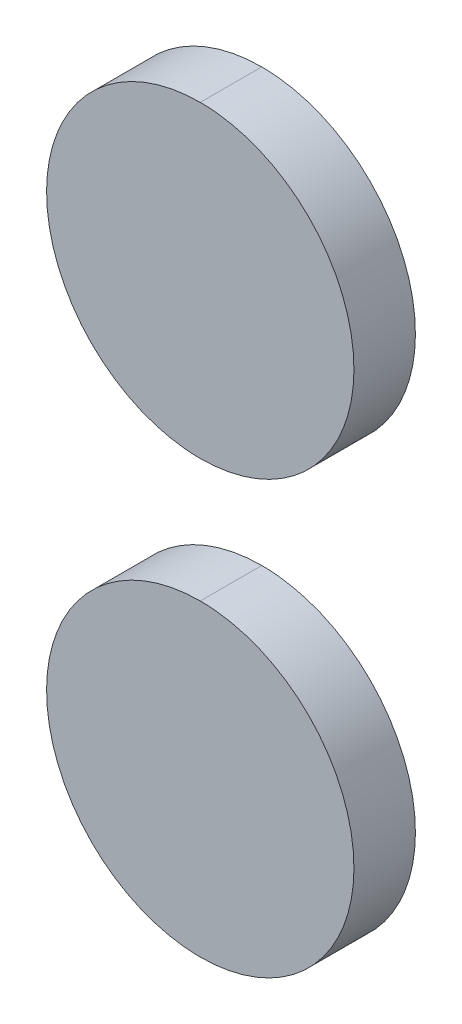
ISO-10303-21;
HEADER;
FILE_DESCRIPTION(('STEP AP214'),'2;1');
FILE_NAME('part.step','',(''),(''),'','','');
FILE_SCHEMA(('AUTOMOTIVE_DESIGN { 1 0 10303 214 1 1 1 1 }'));
ENDSEC;
DATA;
#1=APPLICATION_CONTEXT('core data for automotive mechanical design processes');
#2=APPLICATION_PROTOCOL_DEFINITION('international standard','automotive_design',2000,#1);
#3=PRODUCT_CONTEXT('',#1,'mechanical');
#4=PRODUCT('Part','Part','',(#3));
#5=PRODUCT_RELATED_PRODUCT_CATEGORY('part','',(#4));
#6=PRODUCT_DEFINITION_FORMATION('','',#4);
#7=PRODUCT_DEFINITION_CONTEXT('part definition',#1,'design');
#8=PRODUCT_DEFINITION('design','',#6,#7);
#9=PRODUCT_DEFINITION_SHAPE('','',#8);
#10=(LENGTH_UNIT() NAMED_UNIT(*) SI_UNIT(.MILLI.,.METRE.));
#11=(NAMED_UNIT(*) PLANE_ANGLE_UNIT() SI_UNIT($,.RADIAN.));
#12=(NAMED_UNIT(*) SI_UNIT($,.STERADIAN.) SOLID_ANGLE_UNIT());
#13=UNCERTAINTY_MEASURE_WITH_UNIT(LENGTH_MEASURE(1.E-05),#10,'distance_accuracy_value','');
#14=(GEOMETRIC_REPRESENTATION_CONTEXT(3) GLOBAL_UNCERTAINTY_ASSIGNED_CONTEXT((#13)) GLOBAL_UNIT_ASSIGNED_CONTEXT((#10,
#11,#12)) REPRESENTATION_CONTEXT('',''));
#15=CARTESIAN_POINT('',(0.,0.,0.));
#16=DIRECTION('',(0.,0.,1.));
#17=DIRECTION('',(1.,0.,0.));
#18=AXIS2_PLACEMENT_3D('',#15,#16,#17);
#19=CARTESIAN_POINT('',(5.4,62.520933434628,0.5));
#20=CARTESIAN_POINT('',(5.4,62.520933434628,0.));
#21=CARTESIAN_POINT('',(2.90000000000001,62.520933434628,0.499999999999999));
#22=CARTESIAN_POINT('',(2.90000000000001,62.520933434628,0.));
#23=CARTESIAN_POINT('',(2.90000000000001,60.0122678973796,0.499999999999999));
#24=CARTESIAN_POINT('',(2.90000000000001,60.0122678973796,0.));
#25=CARTESIAN_POINT('',(5.4,60.0122678973796,0.5));
#26=CARTESIAN_POINT('',(5.4,60.0122678973796,0.));
#27=(BOUNDED_SURFACE() B_SPLINE_SURFACE(3,1,((#19,#20),(#21,#22),(#23,#24),(#25,#26)),
.UNSPECIFIED.,.F.,.F.,.F.) B_SPLINE_SURFACE_WITH_KNOTS((4,4),(2,2),(0.,1.),(0.,1.),
.UNSPECIFIED.) GEOMETRIC_REPRESENTATION_ITEM() RATIONAL_B_SPLINE_SURFACE(((1.,1.),
(0.333333333333334,0.333333333333334),(0.333333333333334,0.333333333333334),(1.,1.))) REPRESENTATION_ITEM('') SURFACE());
#28=CARTESIAN_POINT('',(5.4,62.520933434628,0.5));
#29=CARTESIAN_POINT('',(2.90000000000001,62.520933434628,0.499999999999999));
#30=CARTESIAN_POINT('',(2.90000000000001,60.0122678973796,0.499999999999999));
#31=CARTESIAN_POINT('',(5.4,60.0122678973796,0.5));
#32=(BOUNDED_CURVE() B_SPLINE_CURVE(3,(#28,#29,#30,#31),.UNSPECIFIED.,.F.,
.F.) B_SPLINE_CURVE_WITH_KNOTS((4,4),(3.1415926535898,6.28318530717959),
.UNSPECIFIED.) CURVE() GEOMETRIC_REPRESENTATION_ITEM() RATIONAL_B_SPLINE_CURVE((1.,
0.333333333333334,0.333333333333334,1.)) REPRESENTATION_ITEM(''));
#33=CARTESIAN_POINT('',(5.4,62.520933434628,0.5));
#34=VERTEX_POINT('',#33);
#35=CARTESIAN_POINT('',(5.4,60.0122678973796,0.5));
#36=VERTEX_POINT('',#35);
#37=EDGE_CURVE('P0_E40',#34,#36,#32,.T.);
#38=DIRECTION('',(0.,0.,-1.));
#39=VECTOR('',#38,1.);
#40=CARTESIAN_POINT('',(5.4,62.520933434628,0.5));
#41=LINE('',#40,#39);
#42=CARTESIAN_POINT('',(5.4,62.520933434628,0.));
#43=VERTEX_POINT('',#42);
#44=EDGE_CURVE('P0_E11',#34,#43,#41,.T.);
#45=CARTESIAN_POINT('',(5.4,62.520933434628,0.));
#46=CARTESIAN_POINT('',(2.90000000000001,62.520933434628,0.));
#47=CARTESIAN_POINT('',(2.90000000000001,60.0122678973796,0.));
#48=CARTESIAN_POINT('',(5.4,60.0122678973796,0.));
#49=(BOUNDED_CURVE() B_SPLINE_CURVE(3,(#45,#46,#47,#48),.UNSPECIFIED.,.F.,
.F.) B_SPLINE_CURVE_WITH_KNOTS((4,4),(3.1415926535898,6.28318530717959),
.UNSPECIFIED.) CURVE() GEOMETRIC_REPRESENTATION_ITEM() RATIONAL_B_SPLINE_CURVE((1.,
0.333333333333334,0.333333333333334,1.)) REPRESENTATION_ITEM(''));
#50=CARTESIAN_POINT('',(5.4,60.0122678973796,0.));
#51=VERTEX_POINT('',#50);
#52=EDGE_CURVE('P0_E20',#43,#51,#49,.T.);
#53=DIRECTION('',(0.,0.,-1.));
#54=VECTOR('',#53,1.);
#55=CARTESIAN_POINT('',(5.4,60.0122678973796,0.5));
#56=LINE('',#55,#54);
#57=EDGE_CURVE('P0_E59',#36,#51,#56,.T.);
#58=ORIENTED_EDGE('',*,*,#37,.F.);
#59=ORIENTED_EDGE('',*,*,#44,.T.);
#60=ORIENTED_EDGE('',*,*,#52,.T.);
#61=ORIENTED_EDGE('',*,*,#57,.F.);
#62=EDGE_LOOP('',(#58,#59,#60,#61));
#63=FACE_BOUND('',#62,.T.);
#64=ADVANCED_FACE('P0_F16',(#63),#27,.F.);
#65=CARTESIAN_POINT('',(5.4,60.0122678973796,0.5));
#66=CARTESIAN_POINT('',(5.4,60.0122678973796,0.));
#67=CARTESIAN_POINT('',(7.9,60.0122678973796,0.499999999999999));
#68=CARTESIAN_POINT('',(7.9,60.0122678973796,0.));
#69=CARTESIAN_POINT('',(7.9,62.520933434628,0.499999999999999));
#70=CARTESIAN_POINT('',(7.9,62.520933434628,0.));
#71=CARTESIAN_POINT('',(5.4,62.520933434628,0.5));
#72=CARTESIAN_POINT('',(5.4,62.520933434628,0.));
#73=(BOUNDED_SURFACE() B_SPLINE_SURFACE(3,1,((#65,#66),(#67,#68),(#69,#70),(#71,#72)),
.UNSPECIFIED.,.F.,.F.,.F.) B_SPLINE_SURFACE_WITH_KNOTS((4,4),(2,2),(0.,1.),(0.,1.),
.UNSPECIFIED.) GEOMETRIC_REPRESENTATION_ITEM() RATIONAL_B_SPLINE_SURFACE(((1.,1.),
(0.333333333333334,0.333333333333334),(0.333333333333334,0.333333333333334),(1.,1.))) REPRESENTATION_ITEM('') SURFACE());
#74=CARTESIAN_POINT('',(5.4,60.0122678973796,0.5));
#75=CARTESIAN_POINT('',(7.9,60.0122678973796,0.499999999999999));
#76=CARTESIAN_POINT('',(7.9,62.520933434628,0.499999999999999));
#77=CARTESIAN_POINT('',(5.4,62.520933434628,0.5));
#78=(BOUNDED_CURVE() B_SPLINE_CURVE(3,(#74,#75,#76,#77),.UNSPECIFIED.,.F.,
.F.) B_SPLINE_CURVE_WITH_KNOTS((4,4),(0.,3.1415926535898),
.UNSPECIFIED.) CURVE() GEOMETRIC_REPRESENTATION_ITEM() RATIONAL_B_SPLINE_CURVE((1.,
0.333333333333334,0.333333333333334,1.)) REPRESENTATION_ITEM(''));
#79=EDGE_CURVE('P0_E55',#36,#34,#78,.T.);
#80=CARTESIAN_POINT('',(5.4,60.0122678973796,0.));
#81=CARTESIAN_POINT('',(7.9,60.0122678973796,0.));
#82=CARTESIAN_POINT('',(7.9,62.520933434628,0.));
#83=CARTESIAN_POINT('',(5.4,62.520933434628,0.));
#84=(BOUNDED_CURVE() B_SPLINE_CURVE(3,(#80,#81,#82,#83),.UNSPECIFIED.,.F.,
.F.) B_SPLINE_CURVE_WITH_KNOTS((4,4),(0.,3.1415926535898),
.UNSPECIFIED.) CURVE() GEOMETRIC_REPRESENTATION_ITEM() RATIONAL_B_SPLINE_CURVE((1.,
0.333333333333334,0.333333333333334,1.)) REPRESENTATION_ITEM(''));
#85=EDGE_CURVE('P0_E64',#51,#43,#84,.T.);
#86=ORIENTED_EDGE('',*,*,#44,.F.);
#87=ORIENTED_EDGE('',*,*,#79,.F.);
#88=ORIENTED_EDGE('',*,*,#57,.T.);
#89=ORIENTED_EDGE('',*,*,#85,.T.);
#90=EDGE_LOOP('',(#86,#87,#88,#89));
#91=FACE_BOUND('',#90,.T.);
#92=ADVANCED_FACE('P0_F66',(#91),#73,.F.);
#93=CARTESIAN_POINT('',(5.4,61.2666006660038,0.5));
#94=DIRECTION('',(0.,0.,1.));
#95=DIRECTION('',(1.,0.,0.));
#96=AXIS2_PLACEMENT_3D('',#93,#94,#95);
#97=PLANE('',#96);
#98=ORIENTED_EDGE('',*,*,#79,.T.);
#99=ORIENTED_EDGE('',*,*,#37,.T.);
#100=EDGE_LOOP('',(#98,#99));
#101=FACE_BOUND('',#100,.T.);
#102=ADVANCED_FACE('P0_F53',(#101),#97,.T.);
#103=CARTESIAN_POINT('',(5.4,61.2666006660038,0.));
#104=DIRECTION('',(0.,0.,1.));
#105=DIRECTION('',(1.,0.,0.));
#106=AXIS2_PLACEMENT_3D('',#103,#104,#105);
#107=PLANE('',#106);
#108=ORIENTED_EDGE('',*,*,#85,.F.);
#109=ORIENTED_EDGE('',*,*,#52,.F.);
#110=EDGE_LOOP('',(#108,#109));
#111=FACE_BOUND('',#110,.T.);
#112=ADVANCED_FACE('P0_F18',(#111),#107,.F.);
#113=CLOSED_SHELL('',(#64,#92,#102,#112));
#114=MANIFOLD_SOLID_BREP('P0_B1',#113);
#115=CARTESIAN_POINT('',(5.4,59.0088016824802,0.5));
#116=CARTESIAN_POINT('',(5.4,59.0088016824802,0.));
#117=CARTESIAN_POINT('',(2.9,59.0088016824802,0.499999999999999));
#118=CARTESIAN_POINT('',(2.9,59.0088016824802,0.));
#119=CARTESIAN_POINT('',(2.9,56.5001361452319,0.499999999999999));
#120=CARTESIAN_POINT('',(2.9,56.5001361452319,0.));
#121=CARTESIAN_POINT('',(5.4,56.5001361452319,0.5));
#122=CARTESIAN_POINT('',(5.4,56.5001361452319,0.));
#123=(BOUNDED_SURFACE() B_SPLINE_SURFACE(3,1,((#115,#116),(#117,#118),(#119,#120),(#121,#122)),
.UNSPECIFIED.,.F.,.F.,.F.) B_SPLINE_SURFACE_WITH_KNOTS((4,4),(2,2),(0.,1.),(0.,1.),
.UNSPECIFIED.) GEOMETRIC_REPRESENTATION_ITEM() RATIONAL_B_SPLINE_SURFACE(((1.,1.),
(0.333333333333334,0.333333333333334),(0.333333333333334,0.333333333333334),(1.,1.))) REPRESENTATION_ITEM('') SURFACE());
#124=CARTESIAN_POINT('',(5.4,59.0088016824802,0.5));
#125=CARTESIAN_POINT('',(2.9,59.0088016824802,0.499999999999999));
#126=CARTESIAN_POINT('',(2.9,56.5001361452319,0.499999999999999));
#127=CARTESIAN_POINT('',(5.4,56.5001361452319,0.5));
#128=(BOUNDED_CURVE() B_SPLINE_CURVE(3,(#124,#125,#126,#127),.UNSPECIFIED.,.F.,
.F.) B_SPLINE_CURVE_WITH_KNOTS((4,4),(3.1415926535898,6.28318530717959),
.UNSPECIFIED.) CURVE() GEOMETRIC_REPRESENTATION_ITEM() RATIONAL_B_SPLINE_CURVE((1.,
0.333333333333334,0.333333333333334,1.)) REPRESENTATION_ITEM(''));
#129=CARTESIAN_POINT('',(5.4,59.0088016824802,0.5));
#130=VERTEX_POINT('',#129);
#131=CARTESIAN_POINT('',(5.4,56.5001361452319,0.5));
#132=VERTEX_POINT('',#131);
#133=EDGE_CURVE('P1_E44',#130,#132,#128,.T.);
#134=DIRECTION('',(0.,0.,-1.));
#135=VECTOR('',#134,1.);
#136=CARTESIAN_POINT('',(5.4,59.0088016824802,0.5));
#137=LINE('',#136,#135);
#138=CARTESIAN_POINT('',(5.4,59.0088016824802,0.));
#139=VERTEX_POINT('',#138);
#140=EDGE_CURVE('P1_E11',#130,#139,#137,.T.);
#141=CARTESIAN_POINT('',(5.4,59.0088016824802,0.));
#142=CARTESIAN_POINT('',(2.9,59.0088016824802,0.));
#143=CARTESIAN_POINT('',(2.9,56.5001361452319,0.));
#144=CARTESIAN_POINT('',(5.4,56.5001361452319,0.));
#145=(BOUNDED_CURVE() B_SPLINE_CURVE(3,(#141,#142,#143,#144),.UNSPECIFIED.,.F.,
.F.) B_SPLINE_CURVE_WITH_KNOTS((4,4),(3.1415926535898,6.28318530717959),
.UNSPECIFIED.) CURVE() GEOMETRIC_REPRESENTATION_ITEM() RATIONAL_B_SPLINE_CURVE((1.,
0.333333333333334,0.333333333333334,1.)) REPRESENTATION_ITEM(''));
#146=CARTESIAN_POINT('',(5.4,56.5001361452319,0.));
#147=VERTEX_POINT('',#146);
#148=EDGE_CURVE('P1_E31',#139,#147,#145,.T.);
#149=DIRECTION('',(0.,0.,-1.));
#150=VECTOR('',#149,1.);
#151=CARTESIAN_POINT('',(5.4,56.5001361452319,0.5));
#152=LINE('',#151,#150);
#153=EDGE_CURVE('P1_E56',#132,#147,#152,.T.);
#154=ORIENTED_EDGE('',*,*,#133,.F.);
#155=ORIENTED_EDGE('',*,*,#140,.T.);
#156=ORIENTED_EDGE('',*,*,#148,.T.);
#157=ORIENTED_EDGE('',*,*,#153,.F.);
#158=EDGE_LOOP('',(#154,#155,#156,#157));
#159=FACE_BOUND('',#158,.T.);
#160=ADVANCED_FACE('P1_F16',(#159),#123,.F.);
#161=CARTESIAN_POINT('',(5.4,56.5001361452319,0.5));
#162=CARTESIAN_POINT('',(5.4,56.5001361452319,0.));
#163=CARTESIAN_POINT('',(7.9,56.5001361452319,0.499999999999999));
#164=CARTESIAN_POINT('',(7.9,56.5001361452319,0.));
#165=CARTESIAN_POINT('',(7.9,59.0088016824802,0.499999999999999));
#166=CARTESIAN_POINT('',(7.9,59.0088016824802,0.));
#167=CARTESIAN_POINT('',(5.4,59.0088016824802,0.5));
#168=CARTESIAN_POINT('',(5.4,59.0088016824802,0.));
#169=(BOUNDED_SURFACE() B_SPLINE_SURFACE(3,1,((#161,#162),(#163,#164),(#165,#166),(#167,#168)),
.UNSPECIFIED.,.F.,.F.,.F.) B_SPLINE_SURFACE_WITH_KNOTS((4,4),(2,2),(0.,1.),(0.,1.),
.UNSPECIFIED.) GEOMETRIC_REPRESENTATION_ITEM() RATIONAL_B_SPLINE_SURFACE(((1.,1.),
(0.333333333333334,0.333333333333334),(0.333333333333334,0.333333333333334),(1.,1.))) REPRESENTATION_ITEM('') SURFACE());
#170=CARTESIAN_POINT('',(5.4,56.5001361452319,0.5));
#171=CARTESIAN_POINT('',(7.9,56.5001361452319,0.499999999999999));
#172=CARTESIAN_POINT('',(7.9,59.0088016824802,0.499999999999999));
#173=CARTESIAN_POINT('',(5.4,59.0088016824802,0.5));
#174=(BOUNDED_CURVE() B_SPLINE_CURVE(3,(#170,#171,#172,#173),.UNSPECIFIED.,.F.,
.F.) B_SPLINE_CURVE_WITH_KNOTS((4,4),(0.,3.1415926535898),
.UNSPECIFIED.) CURVE() GEOMETRIC_REPRESENTATION_ITEM() RATIONAL_B_SPLINE_CURVE((1.,
0.333333333333334,0.333333333333334,1.)) REPRESENTATION_ITEM(''));
#175=EDGE_CURVE('P1_E22',#132,#130,#174,.T.);
#176=CARTESIAN_POINT('',(5.4,56.5001361452319,0.));
#177=CARTESIAN_POINT('',(7.9,56.5001361452319,0.));
#178=CARTESIAN_POINT('',(7.9,59.0088016824802,0.));
#179=CARTESIAN_POINT('',(5.4,59.0088016824802,0.));
#180=(BOUNDED_CURVE() B_SPLINE_CURVE(3,(#176,#177,#178,#179),.UNSPECIFIED.,.F.,
.F.) B_SPLINE_CURVE_WITH_KNOTS((4,4),(0.,3.1415926535898),
.UNSPECIFIED.) CURVE() GEOMETRIC_REPRESENTATION_ITEM() RATIONAL_B_SPLINE_CURVE((1.,
0.333333333333334,0.333333333333334,1.)) REPRESENTATION_ITEM(''));
#181=EDGE_CURVE('P1_E68',#147,#139,#180,.T.);
#182=ORIENTED_EDGE('',*,*,#140,.F.);
#183=ORIENTED_EDGE('',*,*,#175,.F.);
#184=ORIENTED_EDGE('',*,*,#153,.T.);
#185=ORIENTED_EDGE('',*,*,#181,.T.);
#186=EDGE_LOOP('',(#182,#183,#184,#185));
#187=FACE_BOUND('',#186,.T.);
#188=ADVANCED_FACE('P1_F18',(#187),#169,.F.);
#189=CARTESIAN_POINT('',(5.4,57.7544689138561,0.5));
#190=DIRECTION('',(0.,0.,1.));
#191=DIRECTION('',(1.,0.,0.));
#192=AXIS2_PLACEMENT_3D('',#189,#190,#191);
#193=PLANE('',#192);
#194=ORIENTED_EDGE('',*,*,#175,.T.);
#195=ORIENTED_EDGE('',*,*,#133,.T.);
#196=EDGE_LOOP('',(#194,#195));
#197=FACE_BOUND('',#196,.T.);
#198=ADVANCED_FACE('P1_F63',(#197),#193,.T.);
#199=CARTESIAN_POINT('',(5.4,57.7544689138561,0.));
#200=DIRECTION('',(0.,0.,1.));
#201=DIRECTION('',(1.,0.,0.));
#202=AXIS2_PLACEMENT_3D('',#199,#200,#201);
#203=PLANE('',#202);
#204=ORIENTED_EDGE('',*,*,#181,.F.);
#205=ORIENTED_EDGE('',*,*,#148,.F.);
#206=EDGE_LOOP('',(#204,#205));
#207=FACE_BOUND('',#206,.T.);
#208=ADVANCED_FACE('P1_F137',(#207),#203,.F.);
#209=CLOSED_SHELL('',(#160,#188,#198,#208));
#210=MANIFOLD_SOLID_BREP('P1_B1',#209);
#211=ADVANCED_BREP_SHAPE_REPRESENTATION('',(#18,#114,#210),#14);
#212=SHAPE_DEFINITION_REPRESENTATION(#9,#211);
ENDSEC;
END-ISO-10303-21;
